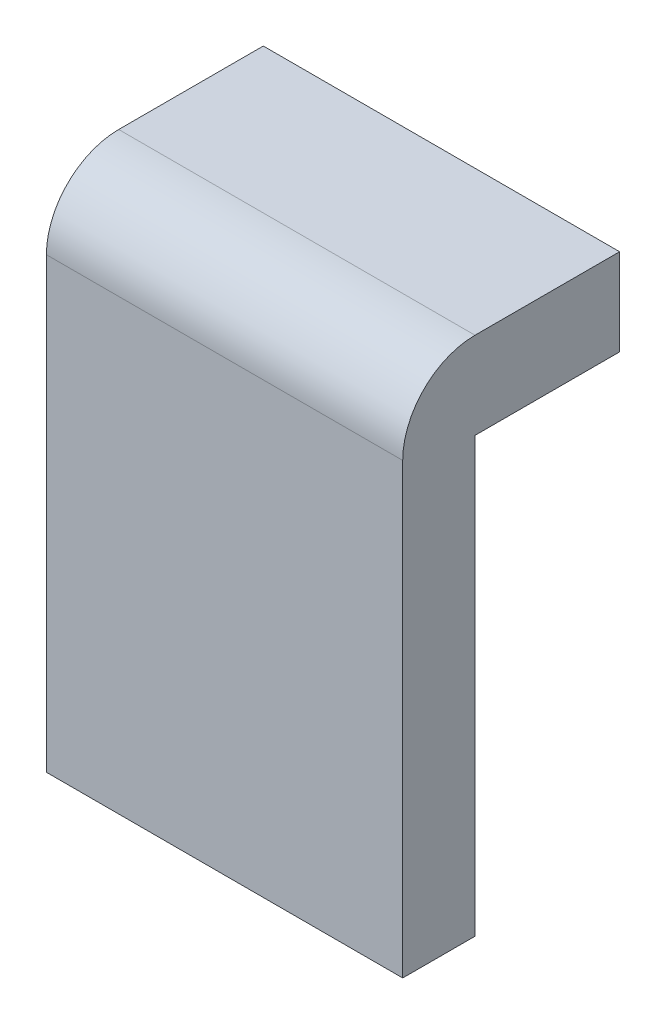
ISO-10303-21;
HEADER;
FILE_DESCRIPTION(('STEP AP214'),'2;1');
FILE_NAME('part.step','',(''),(''),'','','');
FILE_SCHEMA(('AUTOMOTIVE_DESIGN { 1 0 10303 214 1 1 1 1 }'));
ENDSEC;
DATA;
#1=APPLICATION_CONTEXT('core data for automotive mechanical design processes');
#2=APPLICATION_PROTOCOL_DEFINITION('international standard','automotive_design',2000,#1);
#3=PRODUCT_CONTEXT('',#1,'mechanical');
#4=PRODUCT('Part','Part','',(#3));
#5=PRODUCT_RELATED_PRODUCT_CATEGORY('part','',(#4));
#6=PRODUCT_DEFINITION_FORMATION('','',#4);
#7=PRODUCT_DEFINITION_CONTEXT('part definition',#1,'design');
#8=PRODUCT_DEFINITION('design','',#6,#7);
#9=PRODUCT_DEFINITION_SHAPE('','',#8);
#10=(LENGTH_UNIT() NAMED_UNIT(*) SI_UNIT(.MILLI.,.METRE.));
#11=(NAMED_UNIT(*) PLANE_ANGLE_UNIT() SI_UNIT($,.RADIAN.));
#12=(NAMED_UNIT(*) SI_UNIT($,.STERADIAN.) SOLID_ANGLE_UNIT());
#13=UNCERTAINTY_MEASURE_WITH_UNIT(LENGTH_MEASURE(1.E-05),#10,'distance_accuracy_value','');
#14=(GEOMETRIC_REPRESENTATION_CONTEXT(3) GLOBAL_UNCERTAINTY_ASSIGNED_CONTEXT((#13)) GLOBAL_UNIT_ASSIGNED_CONTEXT((#10,
#11,#12)) REPRESENTATION_CONTEXT('',''));
#15=CARTESIAN_POINT('',(0.,0.,0.));
#16=DIRECTION('',(0.,0.,1.));
#17=DIRECTION('',(1.,0.,0.));
#18=AXIS2_PLACEMENT_3D('',#15,#16,#17);
#19=CARTESIAN_POINT('',(-8.34906661620967,8.30000000000001,12.2546737770755));
#20=DIRECTION('',(0.,0.,1.));
#21=DIRECTION('',(0.,-1.,0.));
#22=AXIS2_PLACEMENT_3D('',#19,#20,#21);
#23=PLANE('',#22);
#24=DIRECTION('',(1.,0.,0.));
#25=VECTOR('',#24,1.);
#26=CARTESIAN_POINT('',(-15.8147962412963,6.80000000000003,12.2546737770755));
#27=LINE('',#26,#25);
#28=CARTESIAN_POINT('',(24.2181314712827,6.80000000000003,12.2546737770755));
#29=VERTEX_POINT('',#28);
#30=CARTESIAN_POINT('',(25.4502822277234,6.80000000000003,12.2546737770755));
#31=VERTEX_POINT('',#30);
#32=EDGE_CURVE('E113',#29,#31,#27,.T.);
#33=ORIENTED_EDGE('',*,*,#32,.F.);
#34=DIRECTION('',(0.,1.,0.));
#35=VECTOR('',#34,1.);
#36=CARTESIAN_POINT('',(24.2181314712827,5.35753839337147,12.2546737770755));
#37=LINE('',#36,#35);
#38=CARTESIAN_POINT('',(24.2181314712827,8.30000000000001,12.2546737770755));
#39=VERTEX_POINT('',#38);
#40=EDGE_CURVE('E148',#39,#29,#37,.F.);
#41=ORIENTED_EDGE('',*,*,#40,.F.);
#42=DIRECTION('',(1.,0.,0.));
#43=VECTOR('',#42,1.);
#44=CARTESIAN_POINT('',(-8.34906661620967,8.30000000000001,12.2546737770755));
#45=LINE('',#44,#43);
#46=CARTESIAN_POINT('',(25.4502822277234,8.30000000000001,12.2546737770755));
#47=VERTEX_POINT('',#46);
#48=EDGE_CURVE('E133',#39,#47,#45,.T.);
#49=ORIENTED_EDGE('',*,*,#48,.T.);
#50=DIRECTION('',(0.,1.,0.));
#51=VECTOR('',#50,1.);
#52=CARTESIAN_POINT('',(25.4502822277234,5.35753839337147,12.2546737770755));
#53=LINE('',#52,#51);
#54=EDGE_CURVE('E105',#31,#47,#53,.T.);
#55=ORIENTED_EDGE('',*,*,#54,.F.);
#56=EDGE_LOOP('',(#33,#41,#49,#55));
#57=FACE_BOUND('',#56,.T.);
#58=ADVANCED_FACE('F17',(#57),#23,.F.);
#59=CARTESIAN_POINT('',(-8.34906661620967,8.30000000000001,11.7546737770755));
#60=DIRECTION('',(0.,1.,0.));
#61=DIRECTION('',(0.,0.,1.));
#62=AXIS2_PLACEMENT_3D('',#59,#60,#61);
#63=PLANE('',#62);
#64=ORIENTED_EDGE('',*,*,#48,.F.);
#65=DIRECTION('',(0.,0.,1.));
#66=VECTOR('',#65,1.);
#67=CARTESIAN_POINT('',(24.2181314712827,8.30000000000001,12.5046737770755));
#68=LINE('',#67,#66);
#69=CARTESIAN_POINT('',(24.2181314712827,8.30000000000001,11.7546737770755));
#70=VERTEX_POINT('',#69);
#71=EDGE_CURVE('E153',#70,#39,#68,.T.);
#72=ORIENTED_EDGE('',*,*,#71,.F.);
#73=DIRECTION('',(1.,0.,0.));
#74=VECTOR('',#73,1.);
#75=CARTESIAN_POINT('',(24.2181314712827,8.30000000000001,11.7546737770755));
#76=LINE('',#75,#74);
#77=CARTESIAN_POINT('',(25.4502822277234,8.30000000000001,11.7546737770755));
#78=VERTEX_POINT('',#77);
#79=EDGE_CURVE('E124',#78,#70,#76,.F.);
#80=ORIENTED_EDGE('',*,*,#79,.F.);
#81=DIRECTION('',(0.,0.,-1.));
#82=VECTOR('',#81,1.);
#83=CARTESIAN_POINT('',(25.4502822277234,8.30000000000001,12.5046737770755));
#84=LINE('',#83,#82);
#85=EDGE_CURVE('E129',#47,#78,#84,.T.);
#86=ORIENTED_EDGE('',*,*,#85,.F.);
#87=EDGE_LOOP('',(#64,#72,#80,#86));
#88=FACE_BOUND('',#87,.T.);
#89=ADVANCED_FACE('F175',(#88),#63,.F.);
#90=CARTESIAN_POINT('',(24.2181314712827,5.35753839337146,11.7546737770755));
#91=DIRECTION('',(0.,0.,-1.));
#92=DIRECTION('',(0.,1.,0.));
#93=AXIS2_PLACEMENT_3D('',#90,#91,#92);
#94=PLANE('',#93);
#95=ORIENTED_EDGE('',*,*,#79,.T.);
#96=DIRECTION('',(0.,1.,0.));
#97=VECTOR('',#96,1.);
#98=CARTESIAN_POINT('',(24.2181314712827,5.35753839337147,11.7546737770755));
#99=LINE('',#98,#97);
#100=CARTESIAN_POINT('',(24.2181314712827,8.6,11.7546737770755));
#101=VERTEX_POINT('',#100);
#102=EDGE_CURVE('E119',#101,#70,#99,.F.);
#103=ORIENTED_EDGE('',*,*,#102,.F.);
#104=DIRECTION('',(1.,0.,0.));
#105=VECTOR('',#104,1.);
#106=CARTESIAN_POINT('',(-8.34906661620967,8.6,11.7546737770755));
#107=LINE('',#106,#105);
#108=CARTESIAN_POINT('',(25.4502822277234,8.6,11.7546737770755));
#109=VERTEX_POINT('',#108);
#110=EDGE_CURVE('E122',#101,#109,#107,.T.);
#111=ORIENTED_EDGE('',*,*,#110,.T.);
#112=DIRECTION('',(0.,1.,0.));
#113=VECTOR('',#112,1.);
#114=CARTESIAN_POINT('',(25.4502822277234,5.35753839337147,11.7546737770755));
#115=LINE('',#114,#113);
#116=EDGE_CURVE('E97',#78,#109,#115,.T.);
#117=ORIENTED_EDGE('',*,*,#116,.F.);
#118=EDGE_LOOP('',(#95,#103,#111,#117));
#119=FACE_BOUND('',#118,.T.);
#120=ADVANCED_FACE('F172',(#119),#94,.T.);
#121=CARTESIAN_POINT('',(-8.34906661620967,8.6,11.7546737770755));
#122=DIRECTION('',(0.,-1.,0.));
#123=DIRECTION('',(0.,0.,-1.));
#124=AXIS2_PLACEMENT_3D('',#121,#122,#123);
#125=PLANE('',#124);
#126=ORIENTED_EDGE('',*,*,#110,.F.);
#127=DIRECTION('',(0.,0.,1.));
#128=VECTOR('',#127,1.);
#129=CARTESIAN_POINT('',(24.2181314712827,8.6,12.5046737770755));
#130=LINE('',#129,#128);
#131=CARTESIAN_POINT('',(24.2181314712827,8.6,12.2546737770755));
#132=VERTEX_POINT('',#131);
#133=EDGE_CURVE('E83',#132,#101,#130,.F.);
#134=ORIENTED_EDGE('',*,*,#133,.F.);
#135=DIRECTION('',(1.,0.,0.));
#136=VECTOR('',#135,1.);
#137=CARTESIAN_POINT('',(-8.34906661620967,8.6,12.2546737770755));
#138=LINE('',#137,#136);
#139=CARTESIAN_POINT('',(25.4502822277234,8.6,12.2546737770755));
#140=VERTEX_POINT('',#139);
#141=EDGE_CURVE('E79',#140,#132,#138,.F.);
#142=ORIENTED_EDGE('',*,*,#141,.F.);
#143=DIRECTION('',(0.,0.,-1.));
#144=VECTOR('',#143,1.);
#145=CARTESIAN_POINT('',(25.4502822277234,8.6,12.5046737770755));
#146=LINE('',#145,#144);
#147=EDGE_CURVE('E94',#109,#140,#146,.F.);
#148=ORIENTED_EDGE('',*,*,#147,.F.);
#149=EDGE_LOOP('',(#126,#134,#142,#148));
#150=FACE_BOUND('',#149,.T.);
#151=ADVANCED_FACE('F168',(#150),#125,.F.);
#152=CARTESIAN_POINT('',(-8.34906661620967,8.35,12.2546737770755));
#153=DIRECTION('',(1.,0.,0.));
#154=DIRECTION('',(0.,0.,-1.));
#155=AXIS2_PLACEMENT_3D('',#152,#153,#154);
#156=CYLINDRICAL_SURFACE('',#155,0.249999999999995);
#157=CARTESIAN_POINT('',(24.2181314712827,8.35,12.2546737770755));
#158=DIRECTION('',(1.,0.,0.));
#159=DIRECTION('',(0.,0.,-1.));
#160=AXIS2_PLACEMENT_3D('',#157,#158,#159);
#161=CIRCLE('',#160,0.249999999999995);
#162=CARTESIAN_POINT('',(24.2181314712827,8.35,12.5046737770755));
#163=VERTEX_POINT('',#162);
#164=EDGE_CURVE('E20',#163,#132,#161,.F.);
#165=ORIENTED_EDGE('',*,*,#164,.F.);
#166=DIRECTION('',(1.,0.,0.));
#167=VECTOR('',#166,1.);
#168=CARTESIAN_POINT('',(24.2181314712827,8.35,12.5046737770755));
#169=LINE('',#168,#167);
#170=CARTESIAN_POINT('',(25.4502822277234,8.35,12.5046737770755));
#171=VERTEX_POINT('',#170);
#172=EDGE_CURVE('E77',#171,#163,#169,.F.);
#173=ORIENTED_EDGE('',*,*,#172,.F.);
#174=CARTESIAN_POINT('',(25.4502822277234,8.35,12.2546737770755));
#175=DIRECTION('',(1.,0.,0.));
#176=DIRECTION('',(0.,0.,-1.));
#177=AXIS2_PLACEMENT_3D('',#174,#175,#176);
#178=CIRCLE('',#177,0.249999999999995);
#179=EDGE_CURVE('E106',#140,#171,#178,.T.);
#180=ORIENTED_EDGE('',*,*,#179,.F.);
#181=ORIENTED_EDGE('',*,*,#141,.T.);
#182=EDGE_LOOP('',(#165,#173,#180,#181));
#183=FACE_BOUND('',#182,.T.);
#184=ADVANCED_FACE('F74',(#183),#156,.T.);
#185=CARTESIAN_POINT('',(24.2181314712827,5.35753839337147,12.5046737770755));
#186=DIRECTION('',(-1.,0.,0.));
#187=DIRECTION('',(0.,0.,1.));
#188=AXIS2_PLACEMENT_3D('',#185,#186,#187);
#189=PLANE('',#188);
#190=DIRECTION('',(0.,0.,-1.));
#191=VECTOR('',#190,1.);
#192=CARTESIAN_POINT('',(24.2181314712827,6.80000000000003,12.5046737770755));
#193=LINE('',#192,#191);
#194=CARTESIAN_POINT('',(24.2181314712827,6.80000000000003,12.5046737770755));
#195=VERTEX_POINT('',#194);
#196=EDGE_CURVE('E89',#195,#29,#193,.T.);
#197=ORIENTED_EDGE('',*,*,#196,.F.);
#198=DIRECTION('',(0.,-1.,0.));
#199=VECTOR('',#198,1.);
#200=CARTESIAN_POINT('',(24.2181314712827,5.35753839337147,12.5046737770755));
#201=LINE('',#200,#199);
#202=EDGE_CURVE('E85',#163,#195,#201,.T.);
#203=ORIENTED_EDGE('',*,*,#202,.F.);
#204=ORIENTED_EDGE('',*,*,#164,.T.);
#205=ORIENTED_EDGE('',*,*,#133,.T.);
#206=ORIENTED_EDGE('',*,*,#102,.T.);
#207=ORIENTED_EDGE('',*,*,#71,.T.);
#208=ORIENTED_EDGE('',*,*,#40,.T.);
#209=EDGE_LOOP('',(#197,#203,#204,#205,#206,#207,#208));
#210=FACE_BOUND('',#209,.T.);
#211=ADVANCED_FACE('F86',(#210),#189,.T.);
#212=CARTESIAN_POINT('',(-15.8147962412963,6.80000000000003,12.5046737770755));
#213=DIRECTION('',(0.,-1.,0.));
#214=DIRECTION('',(0.,0.,-1.));
#215=AXIS2_PLACEMENT_3D('',#212,#213,#214);
#216=PLANE('',#215);
#217=DIRECTION('',(1.,0.,0.));
#218=VECTOR('',#217,1.);
#219=CARTESIAN_POINT('',(24.2181314712827,6.80000000000003,12.5046737770755));
#220=LINE('',#219,#218);
#221=CARTESIAN_POINT('',(25.4502822277234,6.80000000000003,12.5046737770755));
#222=VERTEX_POINT('',#221);
#223=EDGE_CURVE('E26',#195,#222,#220,.T.);
#224=ORIENTED_EDGE('',*,*,#223,.F.);
#225=ORIENTED_EDGE('',*,*,#196,.T.);
#226=ORIENTED_EDGE('',*,*,#32,.T.);
#227=DIRECTION('',(0.,0.,-1.));
#228=VECTOR('',#227,1.);
#229=CARTESIAN_POINT('',(25.4502822277234,6.80000000000003,12.5046737770755));
#230=LINE('',#229,#228);
#231=EDGE_CURVE('E35',#222,#31,#230,.T.);
#232=ORIENTED_EDGE('',*,*,#231,.F.);
#233=EDGE_LOOP('',(#224,#225,#226,#232));
#234=FACE_BOUND('',#233,.T.);
#235=ADVANCED_FACE('F179',(#234),#216,.T.);
#236=CARTESIAN_POINT('',(25.4502822277234,5.35753839337147,12.5046737770755));
#237=DIRECTION('',(1.,0.,0.));
#238=DIRECTION('',(0.,0.,-1.));
#239=AXIS2_PLACEMENT_3D('',#236,#237,#238);
#240=PLANE('',#239);
#241=ORIENTED_EDGE('',*,*,#116,.T.);
#242=ORIENTED_EDGE('',*,*,#147,.T.);
#243=ORIENTED_EDGE('',*,*,#179,.T.);
#244=DIRECTION('',(0.,-1.,0.));
#245=VECTOR('',#244,1.);
#246=CARTESIAN_POINT('',(25.4502822277234,5.35753839337147,12.5046737770755));
#247=LINE('',#246,#245);
#248=EDGE_CURVE('E11',#222,#171,#247,.F.);
#249=ORIENTED_EDGE('',*,*,#248,.F.);
#250=ORIENTED_EDGE('',*,*,#231,.T.);
#251=ORIENTED_EDGE('',*,*,#54,.T.);
#252=ORIENTED_EDGE('',*,*,#85,.T.);
#253=EDGE_LOOP('',(#241,#242,#243,#249,#250,#251,#252));
#254=FACE_BOUND('',#253,.T.);
#255=ADVANCED_FACE('F164',(#254),#240,.T.);
#256=CARTESIAN_POINT('',(24.2181314712827,5.35753839337147,12.5046737770755));
#257=DIRECTION('',(0.,0.,1.));
#258=DIRECTION('',(0.,-1.,0.));
#259=AXIS2_PLACEMENT_3D('',#256,#257,#258);
#260=PLANE('',#259);
#261=ORIENTED_EDGE('',*,*,#223,.T.);
#262=ORIENTED_EDGE('',*,*,#248,.T.);
#263=ORIENTED_EDGE('',*,*,#172,.T.);
#264=ORIENTED_EDGE('',*,*,#202,.T.);
#265=EDGE_LOOP('',(#261,#262,#263,#264));
#266=FACE_BOUND('',#265,.T.);
#267=ADVANCED_FACE('F93',(#266),#260,.T.);
#268=CLOSED_SHELL('',(#58,#89,#120,#151,#184,#211,#235,#255,#267));
#269=MANIFOLD_SOLID_BREP('B1',#268);
#270=ADVANCED_BREP_SHAPE_REPRESENTATION('',(#18,#269),#14);
#271=SHAPE_DEFINITION_REPRESENTATION(#9,#270);
ENDSEC;
END-ISO-10303-21;
